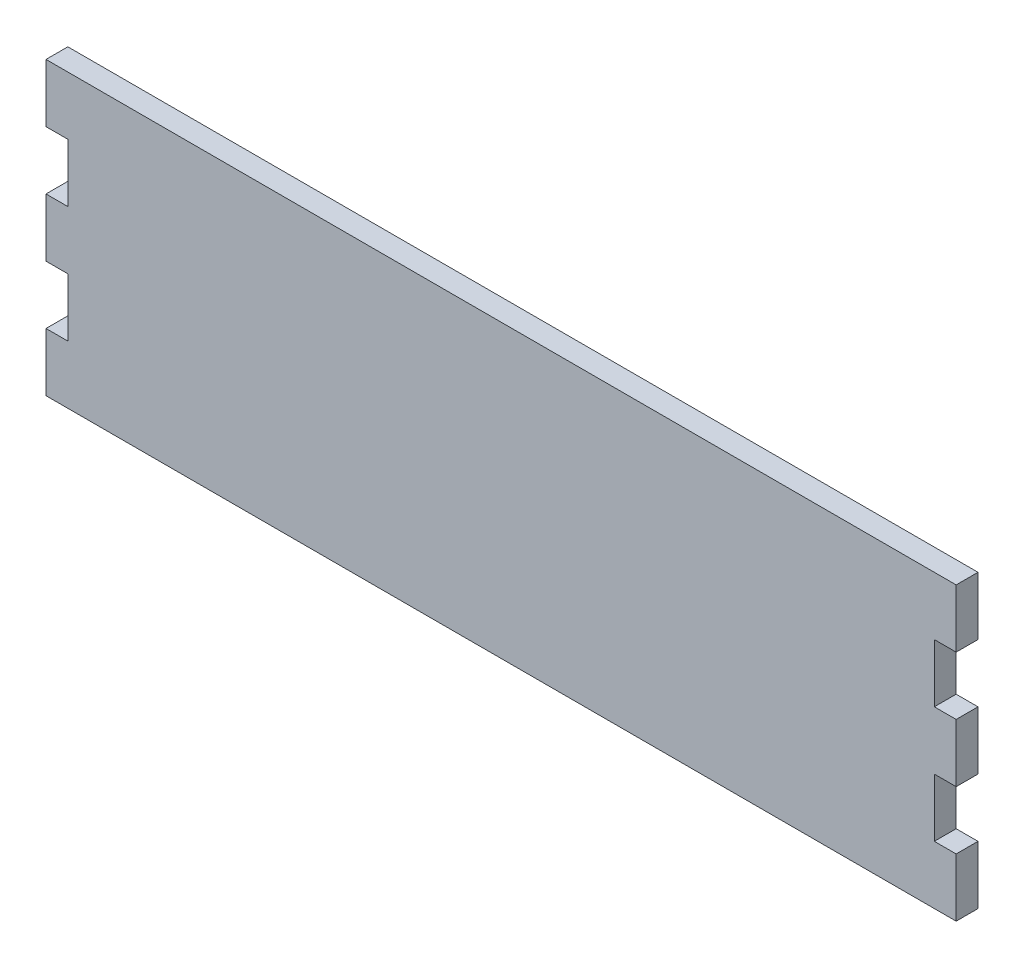
ISO-10303-21;
HEADER;
FILE_DESCRIPTION(('STEP AP214'),'2;1');
FILE_NAME('part.step','',(''),(''),'','','');
FILE_SCHEMA(('AUTOMOTIVE_DESIGN { 1 0 10303 214 1 1 1 1 }'));
ENDSEC;
DATA;
#1=APPLICATION_CONTEXT('core data for automotive mechanical design processes');
#2=APPLICATION_PROTOCOL_DEFINITION('international standard','automotive_design',2000,#1);
#3=PRODUCT_CONTEXT('',#1,'mechanical');
#4=PRODUCT('Part','Part','',(#3));
#5=PRODUCT_RELATED_PRODUCT_CATEGORY('part','',(#4));
#6=PRODUCT_DEFINITION_FORMATION('','',#4);
#7=PRODUCT_DEFINITION_CONTEXT('part definition',#1,'design');
#8=PRODUCT_DEFINITION('design','',#6,#7);
#9=PRODUCT_DEFINITION_SHAPE('','',#8);
#10=(LENGTH_UNIT() NAMED_UNIT(*) SI_UNIT(.MILLI.,.METRE.));
#11=(NAMED_UNIT(*) PLANE_ANGLE_UNIT() SI_UNIT($,.RADIAN.));
#12=(NAMED_UNIT(*) SI_UNIT($,.STERADIAN.) SOLID_ANGLE_UNIT());
#13=UNCERTAINTY_MEASURE_WITH_UNIT(LENGTH_MEASURE(1.E-05),#10,'distance_accuracy_value','');
#14=(GEOMETRIC_REPRESENTATION_CONTEXT(3) GLOBAL_UNCERTAINTY_ASSIGNED_CONTEXT((#13)) GLOBAL_UNIT_ASSIGNED_CONTEXT((#10,
#11,#12)) REPRESENTATION_CONTEXT('',''));
#15=CARTESIAN_POINT('',(0.,0.,0.));
#16=DIRECTION('',(0.,0.,1.));
#17=DIRECTION('',(1.,0.,0.));
#18=AXIS2_PLACEMENT_3D('',#15,#16,#17);
#19=CARTESIAN_POINT('',(-125.,-40.,6.));
#20=DIRECTION('',(1.,0.,0.));
#21=DIRECTION('',(0.,0.,-1.));
#22=AXIS2_PLACEMENT_3D('',#19,#20,#21);
#23=PLANE('',#22);
#24=DIRECTION('',(0.,-1.,0.));
#25=VECTOR('',#24,1.);
#26=CARTESIAN_POINT('',(-125.,-40.,0.));
#27=LINE('',#26,#25);
#28=CARTESIAN_POINT('',(-125.,7.99999999999999,0.));
#29=VERTEX_POINT('',#28);
#30=CARTESIAN_POINT('',(-125.,-8.00000000000002,0.));
#31=VERTEX_POINT('',#30);
#32=EDGE_CURVE('E200',#29,#31,#27,.T.);
#33=ORIENTED_EDGE('',*,*,#32,.T.);
#34=DIRECTION('',(0.,0.,1.));
#35=VECTOR('',#34,1.);
#36=CARTESIAN_POINT('',(-125.,-8.00000000000002,0.));
#37=LINE('',#36,#35);
#38=CARTESIAN_POINT('',(-125.,-8.00000000000002,6.));
#39=VERTEX_POINT('',#38);
#40=EDGE_CURVE('E304',#31,#39,#37,.T.);
#41=ORIENTED_EDGE('',*,*,#40,.T.);
#42=DIRECTION('',(0.,-1.,0.));
#43=VECTOR('',#42,1.);
#44=CARTESIAN_POINT('',(-125.,-40.,6.));
#45=LINE('',#44,#43);
#46=CARTESIAN_POINT('',(-125.,7.99999999999999,6.));
#47=VERTEX_POINT('',#46);
#48=EDGE_CURVE('E316',#47,#39,#45,.T.);
#49=ORIENTED_EDGE('',*,*,#48,.F.);
#50=DIRECTION('',(0.,0.,1.));
#51=VECTOR('',#50,1.);
#52=CARTESIAN_POINT('',(-125.,7.99999999999999,0.));
#53=LINE('',#52,#51);
#54=EDGE_CURVE('E299',#29,#47,#53,.T.);
#55=ORIENTED_EDGE('',*,*,#54,.F.);
#56=EDGE_LOOP('',(#33,#41,#49,#55));
#57=FACE_BOUND('',#56,.T.);
#58=ADVANCED_FACE('F39',(#57),#23,.F.);
#59=CARTESIAN_POINT('',(-125.,40.,0.));
#60=VERTEX_POINT('',#59);
#61=CARTESIAN_POINT('',(-125.,24.,0.));
#62=VERTEX_POINT('',#61);
#63=EDGE_CURVE('E203',#60,#62,#27,.T.);
#64=ORIENTED_EDGE('',*,*,#63,.T.);
#65=DIRECTION('',(0.,0.,1.));
#66=VECTOR('',#65,1.);
#67=CARTESIAN_POINT('',(-125.,24.,0.));
#68=LINE('',#67,#66);
#69=CARTESIAN_POINT('',(-125.,24.,6.));
#70=VERTEX_POINT('',#69);
#71=EDGE_CURVE('E201',#62,#70,#68,.T.);
#72=ORIENTED_EDGE('',*,*,#71,.T.);
#73=CARTESIAN_POINT('',(-125.,40.,6.));
#74=VERTEX_POINT('',#73);
#75=EDGE_CURVE('E312',#74,#70,#45,.T.);
#76=ORIENTED_EDGE('',*,*,#75,.F.);
#77=DIRECTION('',(0.,0.,-1.));
#78=VECTOR('',#77,1.);
#79=CARTESIAN_POINT('',(-125.,40.,6.));
#80=LINE('',#79,#78);
#81=EDGE_CURVE('E225',#74,#60,#80,.T.);
#82=ORIENTED_EDGE('',*,*,#81,.T.);
#83=EDGE_LOOP('',(#64,#72,#76,#82));
#84=FACE_BOUND('',#83,.T.);
#85=ADVANCED_FACE('F333',(#84),#23,.F.);
#86=CARTESIAN_POINT('',(125.,-40.,6.));
#87=DIRECTION('',(-1.,0.,0.));
#88=DIRECTION('',(0.,0.,1.));
#89=AXIS2_PLACEMENT_3D('',#86,#87,#88);
#90=PLANE('',#89);
#91=DIRECTION('',(0.,1.,0.));
#92=VECTOR('',#91,1.);
#93=CARTESIAN_POINT('',(125.,-40.,0.));
#94=LINE('',#93,#92);
#95=CARTESIAN_POINT('',(125.,-8.00000000000002,0.));
#96=VERTEX_POINT('',#95);
#97=CARTESIAN_POINT('',(125.,7.99999999999999,0.));
#98=VERTEX_POINT('',#97);
#99=EDGE_CURVE('E218',#96,#98,#94,.T.);
#100=ORIENTED_EDGE('',*,*,#99,.T.);
#101=DIRECTION('',(0.,0.,1.));
#102=VECTOR('',#101,1.);
#103=CARTESIAN_POINT('',(125.,7.99999999999999,0.));
#104=LINE('',#103,#102);
#105=CARTESIAN_POINT('',(125.,7.99999999999999,6.));
#106=VERTEX_POINT('',#105);
#107=EDGE_CURVE('E255',#98,#106,#104,.T.);
#108=ORIENTED_EDGE('',*,*,#107,.T.);
#109=DIRECTION('',(0.,1.,0.));
#110=VECTOR('',#109,1.);
#111=CARTESIAN_POINT('',(125.,-40.,6.));
#112=LINE('',#111,#110);
#113=CARTESIAN_POINT('',(125.,-8.00000000000002,6.));
#114=VERTEX_POINT('',#113);
#115=EDGE_CURVE('E319',#114,#106,#112,.T.);
#116=ORIENTED_EDGE('',*,*,#115,.F.);
#117=DIRECTION('',(0.,0.,1.));
#118=VECTOR('',#117,1.);
#119=CARTESIAN_POINT('',(125.,-8.00000000000002,0.));
#120=LINE('',#119,#118);
#121=EDGE_CURVE('E263',#96,#114,#120,.T.);
#122=ORIENTED_EDGE('',*,*,#121,.F.);
#123=EDGE_LOOP('',(#100,#108,#116,#122));
#124=FACE_BOUND('',#123,.T.);
#125=ADVANCED_FACE('F361',(#124),#90,.F.);
#126=CARTESIAN_POINT('',(125.,-40.,0.));
#127=VERTEX_POINT('',#126);
#128=CARTESIAN_POINT('',(125.,-24.,0.));
#129=VERTEX_POINT('',#128);
#130=EDGE_CURVE('E220',#127,#129,#94,.T.);
#131=ORIENTED_EDGE('',*,*,#130,.T.);
#132=DIRECTION('',(0.,0.,1.));
#133=VECTOR('',#132,1.);
#134=CARTESIAN_POINT('',(125.,-24.,0.));
#135=LINE('',#134,#133);
#136=CARTESIAN_POINT('',(125.,-24.,6.));
#137=VERTEX_POINT('',#136);
#138=EDGE_CURVE('E252',#129,#137,#135,.T.);
#139=ORIENTED_EDGE('',*,*,#138,.T.);
#140=CARTESIAN_POINT('',(125.,-40.,6.));
#141=VERTEX_POINT('',#140);
#142=EDGE_CURVE('E235',#141,#137,#112,.T.);
#143=ORIENTED_EDGE('',*,*,#142,.F.);
#144=DIRECTION('',(0.,0.,-1.));
#145=VECTOR('',#144,1.);
#146=CARTESIAN_POINT('',(125.,-40.,6.));
#147=LINE('',#146,#145);
#148=EDGE_CURVE('E47',#141,#127,#147,.T.);
#149=ORIENTED_EDGE('',*,*,#148,.T.);
#150=EDGE_LOOP('',(#131,#139,#143,#149));
#151=FACE_BOUND('',#150,.T.);
#152=ADVANCED_FACE('F232',(#151),#90,.F.);
#153=CARTESIAN_POINT('',(-125.,-24.,6.));
#154=VERTEX_POINT('',#153);
#155=CARTESIAN_POINT('',(-125.,-40.,6.));
#156=VERTEX_POINT('',#155);
#157=EDGE_CURVE('E194',#154,#156,#45,.T.);
#158=ORIENTED_EDGE('',*,*,#157,.F.);
#159=DIRECTION('',(0.,0.,1.));
#160=VECTOR('',#159,1.);
#161=CARTESIAN_POINT('',(-125.,-24.,0.));
#162=LINE('',#161,#160);
#163=CARTESIAN_POINT('',(-125.,-24.,0.));
#164=VERTEX_POINT('',#163);
#165=EDGE_CURVE('E180',#164,#154,#162,.T.);
#166=ORIENTED_EDGE('',*,*,#165,.F.);
#167=CARTESIAN_POINT('',(-125.,-40.,0.));
#168=VERTEX_POINT('',#167);
#169=EDGE_CURVE('E192',#164,#168,#27,.T.);
#170=ORIENTED_EDGE('',*,*,#169,.T.);
#171=DIRECTION('',(0.,0.,-1.));
#172=VECTOR('',#171,1.);
#173=CARTESIAN_POINT('',(-125.,-40.,6.));
#174=LINE('',#173,#172);
#175=EDGE_CURVE('E11',#156,#168,#174,.T.);
#176=ORIENTED_EDGE('',*,*,#175,.F.);
#177=EDGE_LOOP('',(#158,#166,#170,#176));
#178=FACE_BOUND('',#177,.T.);
#179=ADVANCED_FACE('F41',(#178),#23,.F.);
#180=CARTESIAN_POINT('',(125.,-40.,6.));
#181=DIRECTION('',(0.,1.,0.));
#182=DIRECTION('',(-1.,0.,0.));
#183=AXIS2_PLACEMENT_3D('',#180,#181,#182);
#184=PLANE('',#183);
#185=DIRECTION('',(1.,0.,0.));
#186=VECTOR('',#185,1.);
#187=CARTESIAN_POINT('',(125.,-40.,0.));
#188=LINE('',#187,#186);
#189=EDGE_CURVE('E199',#168,#127,#188,.T.);
#190=ORIENTED_EDGE('',*,*,#189,.T.);
#191=ORIENTED_EDGE('',*,*,#148,.F.);
#192=DIRECTION('',(1.,0.,0.));
#193=VECTOR('',#192,1.);
#194=CARTESIAN_POINT('',(125.,-40.,6.));
#195=LINE('',#194,#193);
#196=EDGE_CURVE('E315',#156,#141,#195,.T.);
#197=ORIENTED_EDGE('',*,*,#196,.F.);
#198=ORIENTED_EDGE('',*,*,#175,.T.);
#199=EDGE_LOOP('',(#190,#191,#197,#198));
#200=FACE_BOUND('',#199,.T.);
#201=ADVANCED_FACE('F352',(#200),#184,.F.);
#202=CARTESIAN_POINT('',(125.,24.,6.));
#203=VERTEX_POINT('',#202);
#204=CARTESIAN_POINT('',(125.,40.,6.));
#205=VERTEX_POINT('',#204);
#206=EDGE_CURVE('E318',#203,#205,#112,.T.);
#207=ORIENTED_EDGE('',*,*,#206,.F.);
#208=DIRECTION('',(0.,0.,1.));
#209=VECTOR('',#208,1.);
#210=CARTESIAN_POINT('',(125.,24.,0.));
#211=LINE('',#210,#209);
#212=CARTESIAN_POINT('',(125.,24.,0.));
#213=VERTEX_POINT('',#212);
#214=EDGE_CURVE('E274',#213,#203,#211,.T.);
#215=ORIENTED_EDGE('',*,*,#214,.F.);
#216=CARTESIAN_POINT('',(125.,40.,0.));
#217=VERTEX_POINT('',#216);
#218=EDGE_CURVE('E214',#213,#217,#94,.T.);
#219=ORIENTED_EDGE('',*,*,#218,.T.);
#220=DIRECTION('',(0.,0.,-1.));
#221=VECTOR('',#220,1.);
#222=CARTESIAN_POINT('',(125.,40.,6.));
#223=LINE('',#222,#221);
#224=EDGE_CURVE('E227',#205,#217,#223,.T.);
#225=ORIENTED_EDGE('',*,*,#224,.F.);
#226=EDGE_LOOP('',(#207,#215,#219,#225));
#227=FACE_BOUND('',#226,.T.);
#228=ADVANCED_FACE('F354',(#227),#90,.F.);
#229=CARTESIAN_POINT('',(125.,40.,6.));
#230=DIRECTION('',(0.,-1.,0.));
#231=DIRECTION('',(1.,0.,0.));
#232=AXIS2_PLACEMENT_3D('',#229,#230,#231);
#233=PLANE('',#232);
#234=DIRECTION('',(-1.,0.,0.));
#235=VECTOR('',#234,1.);
#236=CARTESIAN_POINT('',(125.,40.,0.));
#237=LINE('',#236,#235);
#238=EDGE_CURVE('E223',#217,#60,#237,.T.);
#239=ORIENTED_EDGE('',*,*,#238,.T.);
#240=ORIENTED_EDGE('',*,*,#81,.F.);
#241=DIRECTION('',(-1.,0.,0.));
#242=VECTOR('',#241,1.);
#243=CARTESIAN_POINT('',(125.,40.,6.));
#244=LINE('',#243,#242);
#245=EDGE_CURVE('E228',#205,#74,#244,.T.);
#246=ORIENTED_EDGE('',*,*,#245,.F.);
#247=ORIENTED_EDGE('',*,*,#224,.T.);
#248=EDGE_LOOP('',(#239,#240,#246,#247));
#249=FACE_BOUND('',#248,.T.);
#250=ADVANCED_FACE('F331',(#249),#233,.F.);
#251=CARTESIAN_POINT('',(0.,0.,6.));
#252=DIRECTION('',(0.,0.,1.));
#253=DIRECTION('',(1.,0.,0.));
#254=AXIS2_PLACEMENT_3D('',#251,#252,#253);
#255=PLANE('',#254);
#256=DIRECTION('',(1.,0.,0.));
#257=VECTOR('',#256,1.);
#258=CARTESIAN_POINT('',(125.,7.99999999999999,6.));
#259=LINE('',#258,#257);
#260=CARTESIAN_POINT('',(119.,7.99999999999999,6.));
#261=VERTEX_POINT('',#260);
#262=EDGE_CURVE('E269',#261,#106,#259,.T.);
#263=ORIENTED_EDGE('',*,*,#262,.F.);
#264=DIRECTION('',(0.,-1.,0.));
#265=VECTOR('',#264,1.);
#266=CARTESIAN_POINT('',(119.,24.,6.));
#267=LINE('',#266,#265);
#268=CARTESIAN_POINT('',(119.,24.,6.));
#269=VERTEX_POINT('',#268);
#270=EDGE_CURVE('E278',#269,#261,#267,.T.);
#271=ORIENTED_EDGE('',*,*,#270,.F.);
#272=DIRECTION('',(-1.,0.,0.));
#273=VECTOR('',#272,1.);
#274=CARTESIAN_POINT('',(125.,24.,6.));
#275=LINE('',#274,#273);
#276=EDGE_CURVE('E275',#203,#269,#275,.T.);
#277=ORIENTED_EDGE('',*,*,#276,.F.);
#278=ORIENTED_EDGE('',*,*,#206,.T.);
#279=ORIENTED_EDGE('',*,*,#245,.T.);
#280=ORIENTED_EDGE('',*,*,#75,.T.);
#281=DIRECTION('',(-1.,0.,0.));
#282=VECTOR('',#281,1.);
#283=CARTESIAN_POINT('',(-125.,24.,6.));
#284=LINE('',#283,#282);
#285=CARTESIAN_POINT('',(-119.,24.,6.));
#286=VERTEX_POINT('',#285);
#287=EDGE_CURVE('E293',#286,#70,#284,.T.);
#288=ORIENTED_EDGE('',*,*,#287,.F.);
#289=DIRECTION('',(0.,1.,0.));
#290=VECTOR('',#289,1.);
#291=CARTESIAN_POINT('',(-119.,24.,6.));
#292=LINE('',#291,#290);
#293=CARTESIAN_POINT('',(-119.,7.99999999999999,6.));
#294=VERTEX_POINT('',#293);
#295=EDGE_CURVE('E303',#294,#286,#292,.T.);
#296=ORIENTED_EDGE('',*,*,#295,.F.);
#297=DIRECTION('',(1.,0.,0.));
#298=VECTOR('',#297,1.);
#299=CARTESIAN_POINT('',(-125.,7.99999999999999,6.));
#300=LINE('',#299,#298);
#301=EDGE_CURVE('E300',#47,#294,#300,.T.);
#302=ORIENTED_EDGE('',*,*,#301,.F.);
#303=ORIENTED_EDGE('',*,*,#48,.T.);
#304=DIRECTION('',(-1.,0.,0.));
#305=VECTOR('',#304,1.);
#306=CARTESIAN_POINT('',(-125.,-8.00000000000002,6.));
#307=LINE('',#306,#305);
#308=CARTESIAN_POINT('',(-119.,-8.00000000000002,6.));
#309=VERTEX_POINT('',#308);
#310=EDGE_CURVE('E187',#309,#39,#307,.T.);
#311=ORIENTED_EDGE('',*,*,#310,.F.);
#312=DIRECTION('',(0.,1.,0.));
#313=VECTOR('',#312,1.);
#314=CARTESIAN_POINT('',(-119.,-24.,6.));
#315=LINE('',#314,#313);
#316=CARTESIAN_POINT('',(-119.,-24.,6.));
#317=VERTEX_POINT('',#316);
#318=EDGE_CURVE('E423',#317,#309,#315,.T.);
#319=ORIENTED_EDGE('',*,*,#318,.F.);
#320=DIRECTION('',(1.,0.,0.));
#321=VECTOR('',#320,1.);
#322=CARTESIAN_POINT('',(-125.,-24.,6.));
#323=LINE('',#322,#321);
#324=EDGE_CURVE('E260',#154,#317,#323,.T.);
#325=ORIENTED_EDGE('',*,*,#324,.F.);
#326=ORIENTED_EDGE('',*,*,#157,.T.);
#327=ORIENTED_EDGE('',*,*,#196,.T.);
#328=ORIENTED_EDGE('',*,*,#142,.T.);
#329=DIRECTION('',(1.,0.,0.));
#330=VECTOR('',#329,1.);
#331=CARTESIAN_POINT('',(125.,-24.,6.));
#332=LINE('',#331,#330);
#333=CARTESIAN_POINT('',(119.,-24.,6.));
#334=VERTEX_POINT('',#333);
#335=EDGE_CURVE('E253',#334,#137,#332,.T.);
#336=ORIENTED_EDGE('',*,*,#335,.F.);
#337=DIRECTION('',(0.,-1.,0.));
#338=VECTOR('',#337,1.);
#339=CARTESIAN_POINT('',(119.,-24.,6.));
#340=LINE('',#339,#338);
#341=CARTESIAN_POINT('',(119.,-8.00000000000002,6.));
#342=VERTEX_POINT('',#341);
#343=EDGE_CURVE('E243',#342,#334,#340,.T.);
#344=ORIENTED_EDGE('',*,*,#343,.F.);
#345=DIRECTION('',(-1.,0.,0.));
#346=VECTOR('',#345,1.);
#347=CARTESIAN_POINT('',(125.,-8.00000000000002,6.));
#348=LINE('',#347,#346);
#349=EDGE_CURVE('E247',#114,#342,#348,.T.);
#350=ORIENTED_EDGE('',*,*,#349,.F.);
#351=ORIENTED_EDGE('',*,*,#115,.T.);
#352=EDGE_LOOP('',(#263,#271,#277,#278,#279,#280,#288,#296,#302,#303,#311,#319,#325,#326,#327,
#328,#336,#344,#350,#351));
#353=FACE_BOUND('',#352,.T.);
#354=ADVANCED_FACE('F324',(#353),#255,.T.);
#355=CARTESIAN_POINT('',(0.,0.,0.));
#356=DIRECTION('',(0.,0.,1.));
#357=DIRECTION('',(1.,0.,0.));
#358=AXIS2_PLACEMENT_3D('',#355,#356,#357);
#359=PLANE('',#358);
#360=DIRECTION('',(0.,-1.,0.));
#361=VECTOR('',#360,1.);
#362=CARTESIAN_POINT('',(119.,24.,0.));
#363=LINE('',#362,#361);
#364=CARTESIAN_POINT('',(119.,24.,0.));
#365=VERTEX_POINT('',#364);
#366=CARTESIAN_POINT('',(119.,7.99999999999999,0.));
#367=VERTEX_POINT('',#366);
#368=EDGE_CURVE('E54',#365,#367,#363,.T.);
#369=ORIENTED_EDGE('',*,*,#368,.T.);
#370=DIRECTION('',(1.,0.,0.));
#371=VECTOR('',#370,1.);
#372=CARTESIAN_POINT('',(125.,7.99999999999999,0.));
#373=LINE('',#372,#371);
#374=EDGE_CURVE('E271',#367,#98,#373,.T.);
#375=ORIENTED_EDGE('',*,*,#374,.T.);
#376=ORIENTED_EDGE('',*,*,#99,.F.);
#377=DIRECTION('',(-1.,0.,0.));
#378=VECTOR('',#377,1.);
#379=CARTESIAN_POINT('',(125.,-8.00000000000002,0.));
#380=LINE('',#379,#378);
#381=CARTESIAN_POINT('',(119.,-8.00000000000002,0.));
#382=VERTEX_POINT('',#381);
#383=EDGE_CURVE('E242',#96,#382,#380,.T.);
#384=ORIENTED_EDGE('',*,*,#383,.T.);
#385=DIRECTION('',(0.,-1.,0.));
#386=VECTOR('',#385,1.);
#387=CARTESIAN_POINT('',(119.,-24.,0.));
#388=LINE('',#387,#386);
#389=CARTESIAN_POINT('',(119.,-24.,0.));
#390=VERTEX_POINT('',#389);
#391=EDGE_CURVE('E62',#382,#390,#388,.T.);
#392=ORIENTED_EDGE('',*,*,#391,.T.);
#393=DIRECTION('',(1.,0.,0.));
#394=VECTOR('',#393,1.);
#395=CARTESIAN_POINT('',(125.,-24.,0.));
#396=LINE('',#395,#394);
#397=EDGE_CURVE('E239',#390,#129,#396,.T.);
#398=ORIENTED_EDGE('',*,*,#397,.T.);
#399=ORIENTED_EDGE('',*,*,#130,.F.);
#400=ORIENTED_EDGE('',*,*,#189,.F.);
#401=ORIENTED_EDGE('',*,*,#169,.F.);
#402=DIRECTION('',(1.,0.,0.));
#403=VECTOR('',#402,1.);
#404=CARTESIAN_POINT('',(-125.,-24.,0.));
#405=LINE('',#404,#403);
#406=CARTESIAN_POINT('',(-119.,-24.,0.));
#407=VERTEX_POINT('',#406);
#408=EDGE_CURVE('E176',#164,#407,#405,.T.);
#409=ORIENTED_EDGE('',*,*,#408,.T.);
#410=DIRECTION('',(0.,1.,0.));
#411=VECTOR('',#410,1.);
#412=CARTESIAN_POINT('',(-119.,-24.,0.));
#413=LINE('',#412,#411);
#414=CARTESIAN_POINT('',(-119.,-8.00000000000002,0.));
#415=VERTEX_POINT('',#414);
#416=EDGE_CURVE('E186',#407,#415,#413,.T.);
#417=ORIENTED_EDGE('',*,*,#416,.T.);
#418=DIRECTION('',(-1.,0.,0.));
#419=VECTOR('',#418,1.);
#420=CARTESIAN_POINT('',(-125.,-8.00000000000002,0.));
#421=LINE('',#420,#419);
#422=EDGE_CURVE('E195',#415,#31,#421,.T.);
#423=ORIENTED_EDGE('',*,*,#422,.T.);
#424=ORIENTED_EDGE('',*,*,#32,.F.);
#425=DIRECTION('',(1.,0.,0.));
#426=VECTOR('',#425,1.);
#427=CARTESIAN_POINT('',(-125.,7.99999999999999,0.));
#428=LINE('',#427,#426);
#429=CARTESIAN_POINT('',(-119.,7.99999999999999,0.));
#430=VERTEX_POINT('',#429);
#431=EDGE_CURVE('E289',#29,#430,#428,.T.);
#432=ORIENTED_EDGE('',*,*,#431,.T.);
#433=DIRECTION('',(0.,1.,0.));
#434=VECTOR('',#433,1.);
#435=CARTESIAN_POINT('',(-119.,24.,0.));
#436=LINE('',#435,#434);
#437=CARTESIAN_POINT('',(-119.,24.,0.));
#438=VERTEX_POINT('',#437);
#439=EDGE_CURVE('E292',#430,#438,#436,.T.);
#440=ORIENTED_EDGE('',*,*,#439,.T.);
#441=DIRECTION('',(-1.,0.,0.));
#442=VECTOR('',#441,1.);
#443=CARTESIAN_POINT('',(-125.,24.,0.));
#444=LINE('',#443,#442);
#445=EDGE_CURVE('E296',#438,#62,#444,.T.);
#446=ORIENTED_EDGE('',*,*,#445,.T.);
#447=ORIENTED_EDGE('',*,*,#63,.F.);
#448=ORIENTED_EDGE('',*,*,#238,.F.);
#449=ORIENTED_EDGE('',*,*,#218,.F.);
#450=DIRECTION('',(-1.,0.,0.));
#451=VECTOR('',#450,1.);
#452=CARTESIAN_POINT('',(125.,24.,0.));
#453=LINE('',#452,#451);
#454=EDGE_CURVE('E266',#213,#365,#453,.T.);
#455=ORIENTED_EDGE('',*,*,#454,.T.);
#456=EDGE_LOOP('',(#369,#375,#376,#384,#392,#398,#399,#400,#401,#409,#417,#423,#424,#432,#440,
#446,#447,#448,#449,#455));
#457=FACE_BOUND('',#456,.T.);
#458=ADVANCED_FACE('F197',(#457),#359,.F.);
#459=CARTESIAN_POINT('',(-125.,24.,0.));
#460=DIRECTION('',(0.,1.,0.));
#461=DIRECTION('',(0.,0.,1.));
#462=AXIS2_PLACEMENT_3D('',#459,#460,#461);
#463=PLANE('',#462);
#464=ORIENTED_EDGE('',*,*,#287,.T.);
#465=ORIENTED_EDGE('',*,*,#71,.F.);
#466=ORIENTED_EDGE('',*,*,#445,.F.);
#467=DIRECTION('',(0.,0.,1.));
#468=VECTOR('',#467,1.);
#469=CARTESIAN_POINT('',(-119.,24.,0.));
#470=LINE('',#469,#468);
#471=EDGE_CURVE('E206',#438,#286,#470,.T.);
#472=ORIENTED_EDGE('',*,*,#471,.T.);
#473=EDGE_LOOP('',(#464,#465,#466,#472));
#474=FACE_BOUND('',#473,.T.);
#475=ADVANCED_FACE('F336',(#474),#463,.F.);
#476=CARTESIAN_POINT('',(-119.,24.,0.));
#477=DIRECTION('',(1.,0.,0.));
#478=DIRECTION('',(0.,0.,-1.));
#479=AXIS2_PLACEMENT_3D('',#476,#477,#478);
#480=PLANE('',#479);
#481=ORIENTED_EDGE('',*,*,#295,.T.);
#482=ORIENTED_EDGE('',*,*,#471,.F.);
#483=ORIENTED_EDGE('',*,*,#439,.F.);
#484=DIRECTION('',(0.,0.,1.));
#485=VECTOR('',#484,1.);
#486=CARTESIAN_POINT('',(-119.,7.99999999999999,0.));
#487=LINE('',#486,#485);
#488=EDGE_CURVE('E309',#430,#294,#487,.T.);
#489=ORIENTED_EDGE('',*,*,#488,.T.);
#490=EDGE_LOOP('',(#481,#482,#483,#489));
#491=FACE_BOUND('',#490,.T.);
#492=ADVANCED_FACE('F340',(#491),#480,.F.);
#493=CARTESIAN_POINT('',(-125.,7.99999999999999,0.));
#494=DIRECTION('',(0.,-1.,0.));
#495=DIRECTION('',(0.,0.,-1.));
#496=AXIS2_PLACEMENT_3D('',#493,#494,#495);
#497=PLANE('',#496);
#498=ORIENTED_EDGE('',*,*,#301,.T.);
#499=ORIENTED_EDGE('',*,*,#488,.F.);
#500=ORIENTED_EDGE('',*,*,#431,.F.);
#501=ORIENTED_EDGE('',*,*,#54,.T.);
#502=EDGE_LOOP('',(#498,#499,#500,#501));
#503=FACE_BOUND('',#502,.T.);
#504=ADVANCED_FACE('F342',(#503),#497,.F.);
#505=CARTESIAN_POINT('',(-125.,-8.00000000000002,0.));
#506=DIRECTION('',(0.,1.,0.));
#507=DIRECTION('',(-1.,0.,0.));
#508=AXIS2_PLACEMENT_3D('',#505,#506,#507);
#509=PLANE('',#508);
#510=ORIENTED_EDGE('',*,*,#310,.T.);
#511=ORIENTED_EDGE('',*,*,#40,.F.);
#512=ORIENTED_EDGE('',*,*,#422,.F.);
#513=DIRECTION('',(0.,0.,1.));
#514=VECTOR('',#513,1.);
#515=CARTESIAN_POINT('',(-119.,-8.00000000000002,0.));
#516=LINE('',#515,#514);
#517=EDGE_CURVE('E421',#415,#309,#516,.T.);
#518=ORIENTED_EDGE('',*,*,#517,.T.);
#519=EDGE_LOOP('',(#510,#511,#512,#518));
#520=FACE_BOUND('',#519,.T.);
#521=ADVANCED_FACE('F383',(#520),#509,.F.);
#522=CARTESIAN_POINT('',(-119.,-24.,0.));
#523=DIRECTION('',(1.,0.,0.));
#524=DIRECTION('',(0.,0.,-1.));
#525=AXIS2_PLACEMENT_3D('',#522,#523,#524);
#526=PLANE('',#525);
#527=ORIENTED_EDGE('',*,*,#318,.T.);
#528=ORIENTED_EDGE('',*,*,#517,.F.);
#529=ORIENTED_EDGE('',*,*,#416,.F.);
#530=DIRECTION('',(0.,0.,1.));
#531=VECTOR('',#530,1.);
#532=CARTESIAN_POINT('',(-119.,-24.,0.));
#533=LINE('',#532,#531);
#534=EDGE_CURVE('E182',#407,#317,#533,.T.);
#535=ORIENTED_EDGE('',*,*,#534,.T.);
#536=EDGE_LOOP('',(#527,#528,#529,#535));
#537=FACE_BOUND('',#536,.T.);
#538=ADVANCED_FACE('F411',(#537),#526,.F.);
#539=CARTESIAN_POINT('',(-125.,-24.,0.));
#540=DIRECTION('',(0.,-1.,0.));
#541=DIRECTION('',(0.,0.,-1.));
#542=AXIS2_PLACEMENT_3D('',#539,#540,#541);
#543=PLANE('',#542);
#544=ORIENTED_EDGE('',*,*,#324,.T.);
#545=ORIENTED_EDGE('',*,*,#534,.F.);
#546=ORIENTED_EDGE('',*,*,#408,.F.);
#547=ORIENTED_EDGE('',*,*,#165,.T.);
#548=EDGE_LOOP('',(#544,#545,#546,#547));
#549=FACE_BOUND('',#548,.T.);
#550=ADVANCED_FACE('F179',(#549),#543,.F.);
#551=CARTESIAN_POINT('',(125.,-24.,0.));
#552=DIRECTION('',(0.,-1.,0.));
#553=DIRECTION('',(0.,0.,-1.));
#554=AXIS2_PLACEMENT_3D('',#551,#552,#553);
#555=PLANE('',#554);
#556=ORIENTED_EDGE('',*,*,#335,.T.);
#557=ORIENTED_EDGE('',*,*,#138,.F.);
#558=ORIENTED_EDGE('',*,*,#397,.F.);
#559=DIRECTION('',(0.,0.,1.));
#560=VECTOR('',#559,1.);
#561=CARTESIAN_POINT('',(119.,-24.,0.));
#562=LINE('',#561,#560);
#563=EDGE_CURVE('E258',#390,#334,#562,.T.);
#564=ORIENTED_EDGE('',*,*,#563,.T.);
#565=EDGE_LOOP('',(#556,#557,#558,#564));
#566=FACE_BOUND('',#565,.T.);
#567=ADVANCED_FACE('F400',(#566),#555,.F.);
#568=CARTESIAN_POINT('',(119.,-24.,0.));
#569=DIRECTION('',(-1.,0.,0.));
#570=DIRECTION('',(0.,0.,1.));
#571=AXIS2_PLACEMENT_3D('',#568,#569,#570);
#572=PLANE('',#571);
#573=ORIENTED_EDGE('',*,*,#343,.T.);
#574=ORIENTED_EDGE('',*,*,#563,.F.);
#575=ORIENTED_EDGE('',*,*,#391,.F.);
#576=DIRECTION('',(0.,0.,1.));
#577=VECTOR('',#576,1.);
#578=CARTESIAN_POINT('',(119.,-8.00000000000002,0.));
#579=LINE('',#578,#577);
#580=EDGE_CURVE('E261',#382,#342,#579,.T.);
#581=ORIENTED_EDGE('',*,*,#580,.T.);
#582=EDGE_LOOP('',(#573,#574,#575,#581));
#583=FACE_BOUND('',#582,.T.);
#584=ADVANCED_FACE('F403',(#583),#572,.F.);
#585=CARTESIAN_POINT('',(125.,-8.00000000000002,0.));
#586=DIRECTION('',(0.,1.,0.));
#587=DIRECTION('',(-1.,0.,0.));
#588=AXIS2_PLACEMENT_3D('',#585,#586,#587);
#589=PLANE('',#588);
#590=ORIENTED_EDGE('',*,*,#349,.T.);
#591=ORIENTED_EDGE('',*,*,#580,.F.);
#592=ORIENTED_EDGE('',*,*,#383,.F.);
#593=ORIENTED_EDGE('',*,*,#121,.T.);
#594=EDGE_LOOP('',(#590,#591,#592,#593));
#595=FACE_BOUND('',#594,.T.);
#596=ADVANCED_FACE('F398',(#595),#589,.F.);
#597=CARTESIAN_POINT('',(125.,7.99999999999999,0.));
#598=DIRECTION('',(0.,-1.,0.));
#599=DIRECTION('',(0.,0.,-1.));
#600=AXIS2_PLACEMENT_3D('',#597,#598,#599);
#601=PLANE('',#600);
#602=ORIENTED_EDGE('',*,*,#262,.T.);
#603=ORIENTED_EDGE('',*,*,#107,.F.);
#604=ORIENTED_EDGE('',*,*,#374,.F.);
#605=DIRECTION('',(0.,0.,1.));
#606=VECTOR('',#605,1.);
#607=CARTESIAN_POINT('',(119.,7.99999999999999,0.));
#608=LINE('',#607,#606);
#609=EDGE_CURVE('E284',#367,#261,#608,.T.);
#610=ORIENTED_EDGE('',*,*,#609,.T.);
#611=EDGE_LOOP('',(#602,#603,#604,#610));
#612=FACE_BOUND('',#611,.T.);
#613=ADVANCED_FACE('F395',(#612),#601,.F.);
#614=CARTESIAN_POINT('',(119.,24.,0.));
#615=DIRECTION('',(-1.,0.,0.));
#616=DIRECTION('',(0.,0.,1.));
#617=AXIS2_PLACEMENT_3D('',#614,#615,#616);
#618=PLANE('',#617);
#619=ORIENTED_EDGE('',*,*,#270,.T.);
#620=ORIENTED_EDGE('',*,*,#609,.F.);
#621=ORIENTED_EDGE('',*,*,#368,.F.);
#622=DIRECTION('',(0.,0.,1.));
#623=VECTOR('',#622,1.);
#624=CARTESIAN_POINT('',(119.,24.,0.));
#625=LINE('',#624,#623);
#626=EDGE_CURVE('E286',#365,#269,#625,.T.);
#627=ORIENTED_EDGE('',*,*,#626,.T.);
#628=EDGE_LOOP('',(#619,#620,#621,#627));
#629=FACE_BOUND('',#628,.T.);
#630=ADVANCED_FACE('F391',(#629),#618,.F.);
#631=CARTESIAN_POINT('',(125.,24.,0.));
#632=DIRECTION('',(0.,1.,0.));
#633=DIRECTION('',(0.,0.,1.));
#634=AXIS2_PLACEMENT_3D('',#631,#632,#633);
#635=PLANE('',#634);
#636=ORIENTED_EDGE('',*,*,#276,.T.);
#637=ORIENTED_EDGE('',*,*,#626,.F.);
#638=ORIENTED_EDGE('',*,*,#454,.F.);
#639=ORIENTED_EDGE('',*,*,#214,.T.);
#640=EDGE_LOOP('',(#636,#637,#638,#639));
#641=FACE_BOUND('',#640,.T.);
#642=ADVANCED_FACE('F388',(#641),#635,.F.);
#643=CLOSED_SHELL('',(#58,#85,#125,#152,#179,#201,#228,#250,#354,#458,#475,#492,#504,#521,#538,
#550,#567,#584,#596,#613,#630,#642));
#644=MANIFOLD_SOLID_BREP('B2',#643);
#645=ADVANCED_BREP_SHAPE_REPRESENTATION('',(#18,#644),#14);
#646=SHAPE_DEFINITION_REPRESENTATION(#9,#645);
ENDSEC;
END-ISO-10303-21;
